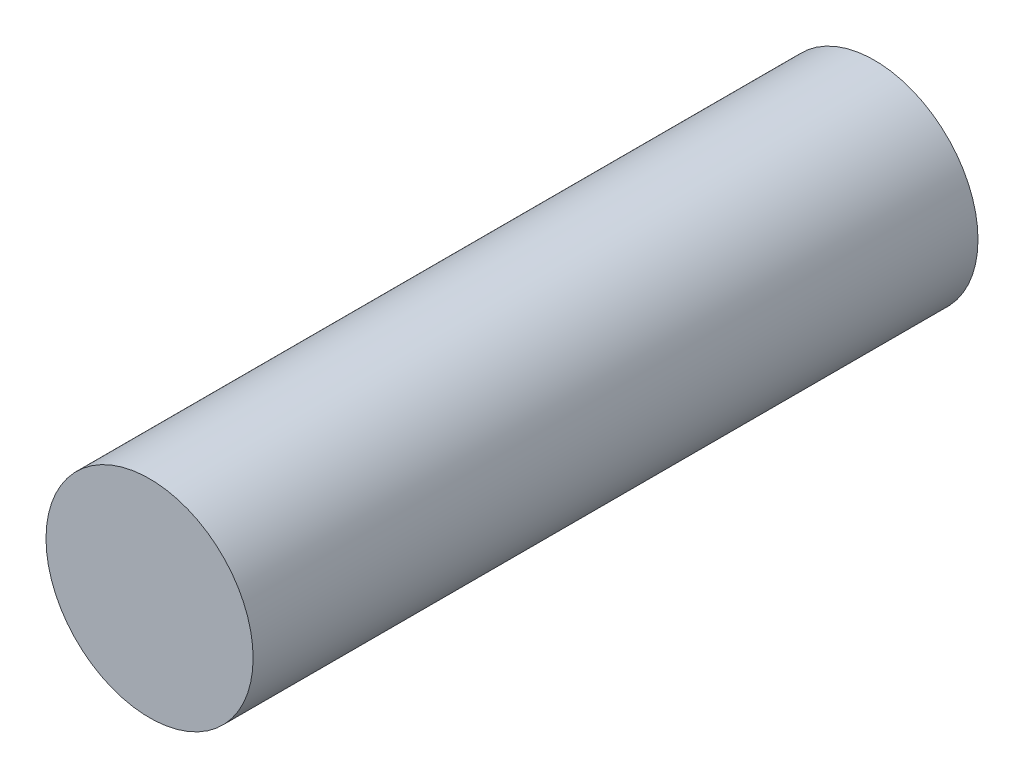
ISO-10303-21;
HEADER;
FILE_DESCRIPTION(('STEP AP214'),'2;1');
FILE_NAME('part.step','',(''),(''),'','','');
FILE_SCHEMA(('AUTOMOTIVE_DESIGN { 1 0 10303 214 1 1 1 1 }'));
ENDSEC;
DATA;
#1=APPLICATION_CONTEXT('core data for automotive mechanical design processes');
#2=APPLICATION_PROTOCOL_DEFINITION('international standard','automotive_design',2000,#1);
#3=PRODUCT_CONTEXT('',#1,'mechanical');
#4=PRODUCT('Part','Part','',(#3));
#5=PRODUCT_RELATED_PRODUCT_CATEGORY('part','',(#4));
#6=PRODUCT_DEFINITION_FORMATION('','',#4);
#7=PRODUCT_DEFINITION_CONTEXT('part definition',#1,'design');
#8=PRODUCT_DEFINITION('design','',#6,#7);
#9=PRODUCT_DEFINITION_SHAPE('','',#8);
#10=(LENGTH_UNIT() NAMED_UNIT(*) SI_UNIT(.MILLI.,.METRE.));
#11=(NAMED_UNIT(*) PLANE_ANGLE_UNIT() SI_UNIT($,.RADIAN.));
#12=(NAMED_UNIT(*) SI_UNIT($,.STERADIAN.) SOLID_ANGLE_UNIT());
#13=UNCERTAINTY_MEASURE_WITH_UNIT(LENGTH_MEASURE(1.E-05),#10,'distance_accuracy_value','');
#14=(GEOMETRIC_REPRESENTATION_CONTEXT(3) GLOBAL_UNCERTAINTY_ASSIGNED_CONTEXT((#13)) GLOBAL_UNIT_ASSIGNED_CONTEXT((#10,
#11,#12)) REPRESENTATION_CONTEXT('',''));
#15=CARTESIAN_POINT('',(0.,0.,0.));
#16=DIRECTION('',(0.,0.,1.));
#17=DIRECTION('',(1.,0.,0.));
#18=AXIS2_PLACEMENT_3D('',#15,#16,#17);
#19=CARTESIAN_POINT('',(0.,0.,35.));
#20=DIRECTION('',(0.,0.,-1.));
#21=DIRECTION('',(-1.,0.,0.));
#22=AXIS2_PLACEMENT_3D('',#19,#20,#21);
#23=CYLINDRICAL_SURFACE('',#22,5.);
#24=CARTESIAN_POINT('',(0.,0.,35.));
#25=DIRECTION('',(0.,0.,1.));
#26=DIRECTION('',(1.,0.,0.));
#27=AXIS2_PLACEMENT_3D('',#24,#25,#26);
#28=CIRCLE('',#27,5.);
#29=CARTESIAN_POINT('',(5.,0.,35.));
#30=VERTEX_POINT('',#29);
#31=EDGE_CURVE('E10',#30,#30,#28,.T.);
#32=ORIENTED_EDGE('',*,*,#31,.F.);
#33=EDGE_LOOP('',(#32));
#34=FACE_BOUND('',#33,.T.);
#35=CARTESIAN_POINT('',(0.,0.,0.));
#36=DIRECTION('',(0.,0.,1.));
#37=DIRECTION('',(1.,0.,0.));
#38=AXIS2_PLACEMENT_3D('',#35,#36,#37);
#39=CIRCLE('',#38,5.);
#40=CARTESIAN_POINT('',(5.,0.,0.));
#41=VERTEX_POINT('',#40);
#42=EDGE_CURVE('E35',#41,#41,#39,.T.);
#43=ORIENTED_EDGE('',*,*,#42,.T.);
#44=EDGE_LOOP('',(#43));
#45=FACE_BOUND('',#44,.T.);
#46=ADVANCED_FACE('F32',(#34,#45),#23,.T.);
#47=CARTESIAN_POINT('',(0.,0.,35.));
#48=DIRECTION('',(0.,0.,1.));
#49=DIRECTION('',(1.,0.,0.));
#50=AXIS2_PLACEMENT_3D('',#47,#48,#49);
#51=PLANE('',#50);
#52=ORIENTED_EDGE('',*,*,#31,.T.);
#53=EDGE_LOOP('',(#52));
#54=FACE_BOUND('',#53,.T.);
#55=ADVANCED_FACE('F47',(#54),#51,.T.);
#56=CARTESIAN_POINT('',(0.,0.,0.));
#57=DIRECTION('',(0.,0.,1.));
#58=DIRECTION('',(1.,0.,0.));
#59=AXIS2_PLACEMENT_3D('',#56,#57,#58);
#60=PLANE('',#59);
#61=ORIENTED_EDGE('',*,*,#42,.F.);
#62=EDGE_LOOP('',(#61));
#63=FACE_BOUND('',#62,.T.);
#64=ADVANCED_FACE('F45',(#63),#60,.F.);
#65=CLOSED_SHELL('',(#46,#55,#64));
#66=MANIFOLD_SOLID_BREP('B2',#65);
#67=ADVANCED_BREP_SHAPE_REPRESENTATION('',(#18,#66),#14);
#68=SHAPE_DEFINITION_REPRESENTATION(#9,#67);
ENDSEC;
END-ISO-10303-21;
